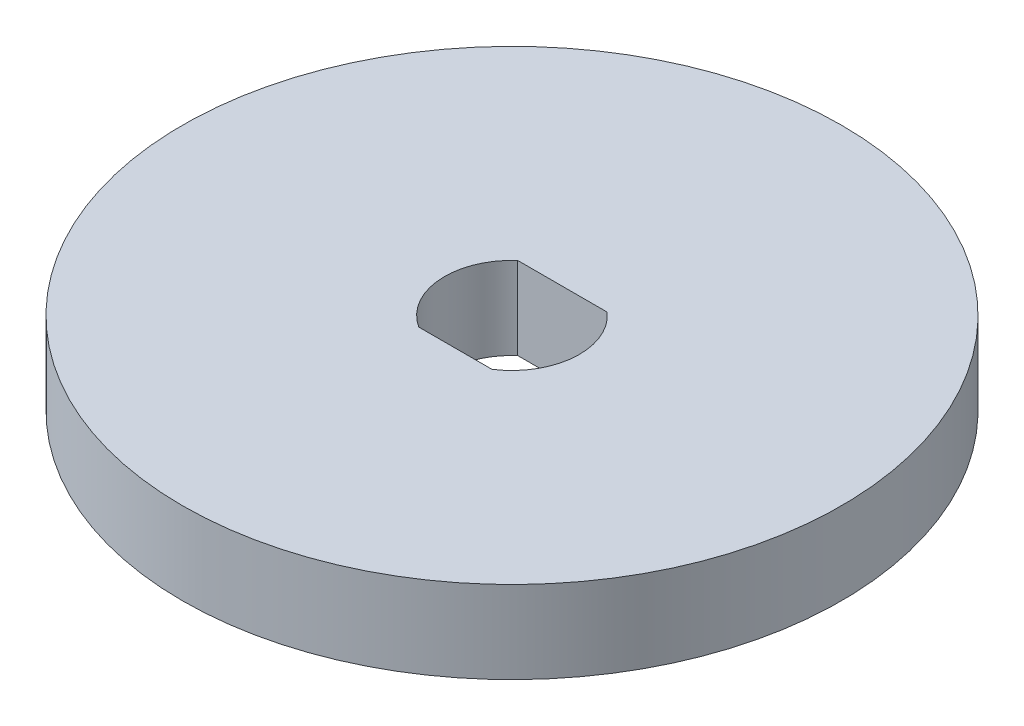
ISO-10303-21;
HEADER;
FILE_DESCRIPTION(('STEP AP214'),'2;1');
FILE_NAME('part.step','',(''),(''),'','','');
FILE_SCHEMA(('AUTOMOTIVE_DESIGN { 1 0 10303 214 1 1 1 1 }'));
ENDSEC;
DATA;
#1=APPLICATION_CONTEXT('core data for automotive mechanical design processes');
#2=APPLICATION_PROTOCOL_DEFINITION('international standard','automotive_design',2000,#1);
#3=PRODUCT_CONTEXT('',#1,'mechanical');
#4=PRODUCT('Part','Part','',(#3));
#5=PRODUCT_RELATED_PRODUCT_CATEGORY('part','',(#4));
#6=PRODUCT_DEFINITION_FORMATION('','',#4);
#7=PRODUCT_DEFINITION_CONTEXT('part definition',#1,'design');
#8=PRODUCT_DEFINITION('design','',#6,#7);
#9=PRODUCT_DEFINITION_SHAPE('','',#8);
#10=(LENGTH_UNIT() NAMED_UNIT(*) SI_UNIT(.MILLI.,.METRE.));
#11=(NAMED_UNIT(*) PLANE_ANGLE_UNIT() SI_UNIT($,.RADIAN.));
#12=(NAMED_UNIT(*) SI_UNIT($,.STERADIAN.) SOLID_ANGLE_UNIT());
#13=UNCERTAINTY_MEASURE_WITH_UNIT(LENGTH_MEASURE(1.E-05),#10,'distance_accuracy_value','');
#14=(GEOMETRIC_REPRESENTATION_CONTEXT(3) GLOBAL_UNCERTAINTY_ASSIGNED_CONTEXT((#13)) GLOBAL_UNIT_ASSIGNED_CONTEXT((#10,
#11,#12)) REPRESENTATION_CONTEXT('',''));
#15=CARTESIAN_POINT('',(0.,0.,0.));
#16=DIRECTION('',(0.,0.,1.));
#17=DIRECTION('',(1.,0.,0.));
#18=AXIS2_PLACEMENT_3D('',#15,#16,#17);
#19=CARTESIAN_POINT('',(0.,3.175,0.));
#20=DIRECTION('',(0.,1.,0.));
#21=DIRECTION('',(0.,0.,1.));
#22=AXIS2_PLACEMENT_3D('',#19,#20,#21);
#23=PLANE('',#22);
#24=CARTESIAN_POINT('',(0.,3.175,0.));
#25=DIRECTION('',(0.,1.,0.));
#26=DIRECTION('',(0.,0.,1.));
#27=AXIS2_PLACEMENT_3D('',#24,#25,#26);
#28=CIRCLE('',#27,12.7);
#29=CARTESIAN_POINT('',(0.,3.175,12.7));
#30=VERTEX_POINT('',#29);
#31=EDGE_CURVE('E11',#30,#30,#28,.T.);
#32=ORIENTED_EDGE('',*,*,#31,.T.);
#33=EDGE_LOOP('',(#32));
#34=FACE_BOUND('',#33,.T.);
#35=DIRECTION('',(1.,0.,0.));
#36=VECTOR('',#35,1.);
#37=CARTESIAN_POINT('',(-1.40971320674895,3.175,2.18465298725395));
#38=LINE('',#37,#36);
#39=CARTESIAN_POINT('',(-1.40971320674895,3.175,2.18465298725395));
#40=VERTEX_POINT('',#39);
#41=CARTESIAN_POINT('',(1.40971320674895,3.175,2.18465298725395));
#42=VERTEX_POINT('',#41);
#43=EDGE_CURVE('E84',#40,#42,#38,.T.);
#44=ORIENTED_EDGE('',*,*,#43,.F.);
#45=CARTESIAN_POINT('',(0.,3.175,0.));
#46=DIRECTION('',(0.,1.,0.));
#47=DIRECTION('',(0.,0.,1.));
#48=AXIS2_PLACEMENT_3D('',#45,#46,#47);
#49=CIRCLE('',#48,2.6);
#50=CARTESIAN_POINT('',(-1.725,3.175,-1.94534701274605));
#51=VERTEX_POINT('',#50);
#52=EDGE_CURVE('E76',#51,#40,#49,.T.);
#53=ORIENTED_EDGE('',*,*,#52,.F.);
#54=DIRECTION('',(-1.,0.,0.));
#55=VECTOR('',#54,1.);
#56=CARTESIAN_POINT('',(-1.725,3.175,-1.94534701274605));
#57=LINE('',#56,#55);
#58=CARTESIAN_POINT('',(1.725,3.175,-1.94534701274605));
#59=VERTEX_POINT('',#58);
#60=EDGE_CURVE('E97',#59,#51,#57,.T.);
#61=ORIENTED_EDGE('',*,*,#60,.F.);
#62=CARTESIAN_POINT('',(0.,3.175,0.));
#63=DIRECTION('',(0.,1.,0.));
#64=DIRECTION('',(0.,0.,1.));
#65=AXIS2_PLACEMENT_3D('',#62,#63,#64);
#66=CIRCLE('',#65,2.6);
#67=EDGE_CURVE('E95',#42,#59,#66,.T.);
#68=ORIENTED_EDGE('',*,*,#67,.F.);
#69=EDGE_LOOP('',(#44,#53,#61,#68));
#70=FACE_BOUND('',#69,.T.);
#71=ADVANCED_FACE('F35',(#34,#70),#23,.T.);
#72=CARTESIAN_POINT('',(0.,0.,0.));
#73=DIRECTION('',(0.,1.,0.));
#74=DIRECTION('',(0.,0.,1.));
#75=AXIS2_PLACEMENT_3D('',#72,#73,#74);
#76=PLANE('',#75);
#77=CARTESIAN_POINT('',(0.,0.,0.));
#78=DIRECTION('',(0.,1.,0.));
#79=DIRECTION('',(0.,0.,1.));
#80=AXIS2_PLACEMENT_3D('',#77,#78,#79);
#81=CIRCLE('',#80,12.7);
#82=CARTESIAN_POINT('',(0.,0.,12.7));
#83=VERTEX_POINT('',#82);
#84=EDGE_CURVE('E39',#83,#83,#81,.T.);
#85=ORIENTED_EDGE('',*,*,#84,.F.);
#86=EDGE_LOOP('',(#85));
#87=FACE_BOUND('',#86,.T.);
#88=CARTESIAN_POINT('',(0.,0.,0.));
#89=DIRECTION('',(0.,1.,0.));
#90=DIRECTION('',(0.,0.,1.));
#91=AXIS2_PLACEMENT_3D('',#88,#89,#90);
#92=CIRCLE('',#91,2.6);
#93=CARTESIAN_POINT('',(-1.725,0.,-1.94534701274605));
#94=VERTEX_POINT('',#93);
#95=CARTESIAN_POINT('',(-1.40971320674895,0.,2.18465298725395));
#96=VERTEX_POINT('',#95);
#97=EDGE_CURVE('E58',#94,#96,#92,.T.);
#98=ORIENTED_EDGE('',*,*,#97,.T.);
#99=DIRECTION('',(1.,0.,0.));
#100=VECTOR('',#99,1.);
#101=CARTESIAN_POINT('',(-1.40971320674895,0.,2.18465298725395));
#102=LINE('',#101,#100);
#103=CARTESIAN_POINT('',(1.40971320674895,0.,2.18465298725395));
#104=VERTEX_POINT('',#103);
#105=EDGE_CURVE('E91',#96,#104,#102,.T.);
#106=ORIENTED_EDGE('',*,*,#105,.T.);
#107=CARTESIAN_POINT('',(0.,0.,0.));
#108=DIRECTION('',(0.,1.,0.));
#109=DIRECTION('',(0.,0.,1.));
#110=AXIS2_PLACEMENT_3D('',#107,#108,#109);
#111=CIRCLE('',#110,2.6);
#112=CARTESIAN_POINT('',(1.725,0.,-1.94534701274605));
#113=VERTEX_POINT('',#112);
#114=EDGE_CURVE('E103',#104,#113,#111,.T.);
#115=ORIENTED_EDGE('',*,*,#114,.T.);
#116=DIRECTION('',(-1.,0.,0.));
#117=VECTOR('',#116,1.);
#118=CARTESIAN_POINT('',(-1.725,0.,-1.94534701274605));
#119=LINE('',#118,#117);
#120=EDGE_CURVE('E85',#113,#94,#119,.T.);
#121=ORIENTED_EDGE('',*,*,#120,.T.);
#122=EDGE_LOOP('',(#98,#106,#115,#121));
#123=FACE_BOUND('',#122,.T.);
#124=ADVANCED_FACE('F114',(#87,#123),#76,.F.);
#125=CARTESIAN_POINT('',(0.,3.175,0.));
#126=DIRECTION('',(0.,-1.,0.));
#127=DIRECTION('',(0.,0.,-1.));
#128=AXIS2_PLACEMENT_3D('',#125,#126,#127);
#129=CYLINDRICAL_SURFACE('',#128,12.7);
#130=ORIENTED_EDGE('',*,*,#31,.F.);
#131=EDGE_LOOP('',(#130));
#132=FACE_BOUND('',#131,.T.);
#133=ORIENTED_EDGE('',*,*,#84,.T.);
#134=EDGE_LOOP('',(#133));
#135=FACE_BOUND('',#134,.T.);
#136=ADVANCED_FACE('F37',(#132,#135),#129,.T.);
#137=CARTESIAN_POINT('',(0.,3.175,0.));
#138=DIRECTION('',(0.,-1.,0.));
#139=DIRECTION('',(0.,0.,-1.));
#140=AXIS2_PLACEMENT_3D('',#137,#138,#139);
#141=CYLINDRICAL_SURFACE('',#140,2.6);
#142=ORIENTED_EDGE('',*,*,#97,.F.);
#143=DIRECTION('',(0.,-1.,0.));
#144=VECTOR('',#143,1.);
#145=CARTESIAN_POINT('',(-1.725,3.175,-1.94534701274605));
#146=LINE('',#145,#144);
#147=EDGE_CURVE('E80',#51,#94,#146,.T.);
#148=ORIENTED_EDGE('',*,*,#147,.F.);
#149=ORIENTED_EDGE('',*,*,#52,.T.);
#150=DIRECTION('',(0.,-1.,0.));
#151=VECTOR('',#150,1.);
#152=CARTESIAN_POINT('',(-1.40971320674895,3.175,2.18465298725395));
#153=LINE('',#152,#151);
#154=EDGE_CURVE('E79',#40,#96,#153,.T.);
#155=ORIENTED_EDGE('',*,*,#154,.T.);
#156=EDGE_LOOP('',(#142,#148,#149,#155));
#157=FACE_BOUND('',#156,.T.);
#158=ADVANCED_FACE('F78',(#157),#141,.F.);
#159=CARTESIAN_POINT('',(-1.40971320674895,3.175,2.18465298725395));
#160=DIRECTION('',(0.,0.,-1.));
#161=DIRECTION('',(-1.,0.,0.));
#162=AXIS2_PLACEMENT_3D('',#159,#160,#161);
#163=PLANE('',#162);
#164=ORIENTED_EDGE('',*,*,#105,.F.);
#165=ORIENTED_EDGE('',*,*,#154,.F.);
#166=ORIENTED_EDGE('',*,*,#43,.T.);
#167=DIRECTION('',(0.,-1.,0.));
#168=VECTOR('',#167,1.);
#169=CARTESIAN_POINT('',(1.40971320674895,3.175,2.18465298725395));
#170=LINE('',#169,#168);
#171=EDGE_CURVE('E92',#42,#104,#170,.T.);
#172=ORIENTED_EDGE('',*,*,#171,.T.);
#173=EDGE_LOOP('',(#164,#165,#166,#172));
#174=FACE_BOUND('',#173,.T.);
#175=ADVANCED_FACE('F88',(#174),#163,.T.);
#176=CARTESIAN_POINT('',(0.,3.175,0.));
#177=DIRECTION('',(0.,-1.,0.));
#178=DIRECTION('',(0.,0.,-1.));
#179=AXIS2_PLACEMENT_3D('',#176,#177,#178);
#180=CYLINDRICAL_SURFACE('',#179,2.6);
#181=ORIENTED_EDGE('',*,*,#114,.F.);
#182=ORIENTED_EDGE('',*,*,#171,.F.);
#183=ORIENTED_EDGE('',*,*,#67,.T.);
#184=DIRECTION('',(0.,-1.,0.));
#185=VECTOR('',#184,1.);
#186=CARTESIAN_POINT('',(1.725,3.175,-1.94534701274605));
#187=LINE('',#186,#185);
#188=EDGE_CURVE('E50',#59,#113,#187,.T.);
#189=ORIENTED_EDGE('',*,*,#188,.T.);
#190=EDGE_LOOP('',(#181,#182,#183,#189));
#191=FACE_BOUND('',#190,.T.);
#192=ADVANCED_FACE('F112',(#191),#180,.F.);
#193=CARTESIAN_POINT('',(-1.725,3.175,-1.94534701274605));
#194=DIRECTION('',(0.,0.,1.));
#195=DIRECTION('',(1.,0.,0.));
#196=AXIS2_PLACEMENT_3D('',#193,#194,#195);
#197=PLANE('',#196);
#198=ORIENTED_EDGE('',*,*,#120,.F.);
#199=ORIENTED_EDGE('',*,*,#188,.F.);
#200=ORIENTED_EDGE('',*,*,#60,.T.);
#201=ORIENTED_EDGE('',*,*,#147,.T.);
#202=EDGE_LOOP('',(#198,#199,#200,#201));
#203=FACE_BOUND('',#202,.T.);
#204=ADVANCED_FACE('F115',(#203),#197,.T.);
#205=CLOSED_SHELL('',(#71,#124,#136,#158,#175,#192,#204));
#206=MANIFOLD_SOLID_BREP('B2',#205);
#207=ADVANCED_BREP_SHAPE_REPRESENTATION('',(#18,#206),#14);
#208=SHAPE_DEFINITION_REPRESENTATION(#9,#207);
ENDSEC;
END-ISO-10303-21;
